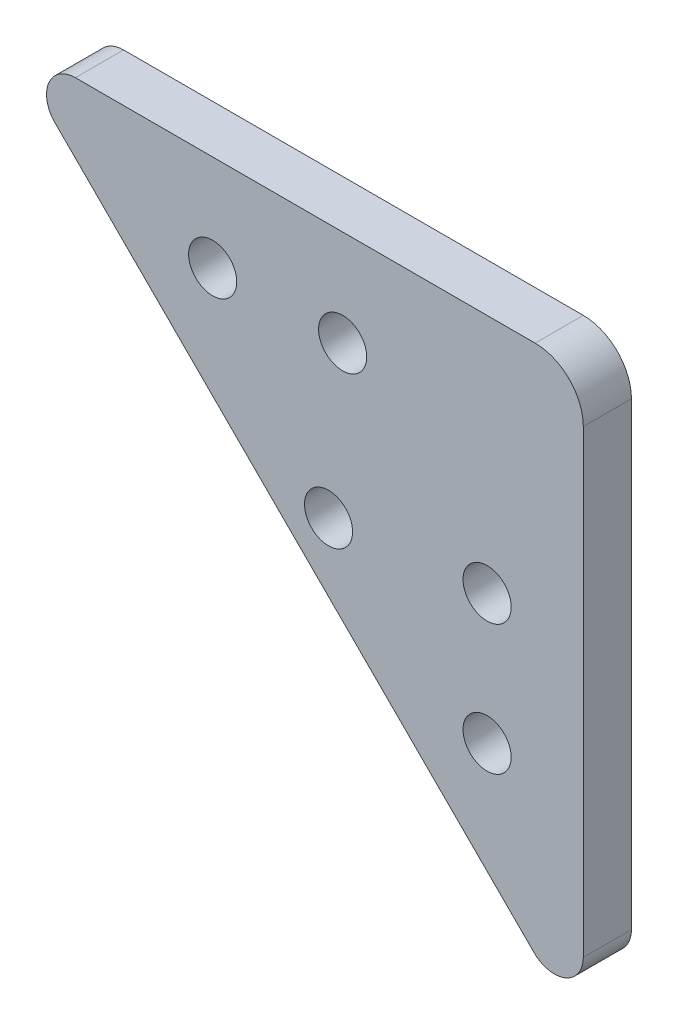
ISO-10303-21;
HEADER;
FILE_DESCRIPTION(('STEP AP214'),'2;1');
FILE_NAME('part.step','',(''),(''),'','','');
FILE_SCHEMA(('AUTOMOTIVE_DESIGN { 1 0 10303 214 1 1 1 1 }'));
ENDSEC;
DATA;
#1=APPLICATION_CONTEXT('core data for automotive mechanical design processes');
#2=APPLICATION_PROTOCOL_DEFINITION('international standard','automotive_design',2000,#1);
#3=PRODUCT_CONTEXT('',#1,'mechanical');
#4=PRODUCT('Part','Part','',(#3));
#5=PRODUCT_RELATED_PRODUCT_CATEGORY('part','',(#4));
#6=PRODUCT_DEFINITION_FORMATION('','',#4);
#7=PRODUCT_DEFINITION_CONTEXT('part definition',#1,'design');
#8=PRODUCT_DEFINITION('design','',#6,#7);
#9=PRODUCT_DEFINITION_SHAPE('','',#8);
#10=(LENGTH_UNIT() NAMED_UNIT(*) SI_UNIT(.MILLI.,.METRE.));
#11=(NAMED_UNIT(*) PLANE_ANGLE_UNIT() SI_UNIT($,.RADIAN.));
#12=(NAMED_UNIT(*) SI_UNIT($,.STERADIAN.) SOLID_ANGLE_UNIT());
#13=UNCERTAINTY_MEASURE_WITH_UNIT(LENGTH_MEASURE(1.E-05),#10,'distance_accuracy_value','');
#14=(GEOMETRIC_REPRESENTATION_CONTEXT(3) GLOBAL_UNCERTAINTY_ASSIGNED_CONTEXT((#13)) GLOBAL_UNIT_ASSIGNED_CONTEXT((#10,
#11,#12)) REPRESENTATION_CONTEXT('',''));
#15=CARTESIAN_POINT('',(0.,0.,0.));
#16=DIRECTION('',(0.,0.,1.));
#17=DIRECTION('',(1.,0.,0.));
#18=AXIS2_PLACEMENT_3D('',#15,#16,#17);
#19=CARTESIAN_POINT('',(25.,25.,5.));
#20=DIRECTION('',(0.,0.,-1.));
#21=DIRECTION('',(-1.,0.,0.));
#22=AXIS2_PLACEMENT_3D('',#19,#20,#21);
#23=PLANE('',#22);
#24=CARTESIAN_POINT('',(25.,25.,5.));
#25=DIRECTION('',(0.,0.,1.));
#26=DIRECTION('',(-1.,0.,0.));
#27=AXIS2_PLACEMENT_3D('',#24,#25,#26);
#28=CIRCLE('',#27,5.);
#29=CARTESIAN_POINT('',(30.,25.,5.));
#30=VERTEX_POINT('',#29);
#31=CARTESIAN_POINT('',(25.,30.,5.));
#32=VERTEX_POINT('',#31);
#33=EDGE_CURVE('E131',#30,#32,#28,.T.);
#34=ORIENTED_EDGE('',*,*,#33,.T.);
#35=DIRECTION('',(-1.,0.,0.));
#36=VECTOR('',#35,1.);
#37=CARTESIAN_POINT('',(-22.7573593128808,30.,5.));
#38=LINE('',#37,#36);
#39=CARTESIAN_POINT('',(-22.7573593128808,30.,5.));
#40=VERTEX_POINT('',#39);
#41=EDGE_CURVE('E89',#32,#40,#38,.T.);
#42=ORIENTED_EDGE('',*,*,#41,.T.);
#43=CARTESIAN_POINT('',(-22.7573593128808,27.,5.));
#44=DIRECTION('',(0.,0.,1.));
#45=DIRECTION('',(1.,0.,0.));
#46=AXIS2_PLACEMENT_3D('',#43,#44,#45);
#47=CIRCLE('',#46,3.00000000000001);
#48=CARTESIAN_POINT('',(-24.8786796564405,24.8786796564404,5.));
#49=VERTEX_POINT('',#48);
#50=EDGE_CURVE('E102',#40,#49,#47,.T.);
#51=ORIENTED_EDGE('',*,*,#50,.T.);
#52=DIRECTION('',(0.707106781186542,-0.707106781186553,0.));
#53=VECTOR('',#52,1.);
#54=CARTESIAN_POINT('',(24.8786796564403,-24.8786796564412,5.));
#55=LINE('',#54,#53);
#56=CARTESIAN_POINT('',(24.8786796564403,-24.8786796564412,5.));
#57=VERTEX_POINT('',#56);
#58=EDGE_CURVE('E96',#49,#57,#55,.T.);
#59=ORIENTED_EDGE('',*,*,#58,.T.);
#60=CARTESIAN_POINT('',(27.,-22.7573593128816,5.));
#61=DIRECTION('',(0.,0.,1.));
#62=DIRECTION('',(-1.,0.,0.));
#63=AXIS2_PLACEMENT_3D('',#60,#61,#62);
#64=CIRCLE('',#63,3.);
#65=CARTESIAN_POINT('',(30.,-22.7573593128816,5.));
#66=VERTEX_POINT('',#65);
#67=EDGE_CURVE('E100',#57,#66,#64,.T.);
#68=ORIENTED_EDGE('',*,*,#67,.T.);
#69=DIRECTION('',(0.,1.,0.));
#70=VECTOR('',#69,1.);
#71=CARTESIAN_POINT('',(30.,25.,5.));
#72=LINE('',#71,#70);
#73=EDGE_CURVE('E52',#66,#30,#72,.T.);
#74=ORIENTED_EDGE('',*,*,#73,.T.);
#75=EDGE_LOOP('',(#34,#42,#51,#59,#68,#74));
#76=FACE_BOUND('',#75,.T.);
#77=CARTESIAN_POINT('',(4.99999999999998,20.0064423388467,5.));
#78=DIRECTION('',(0.,0.,1.));
#79=DIRECTION('',(1.,0.,0.));
#80=AXIS2_PLACEMENT_3D('',#77,#78,#79);
#81=CIRCLE('',#80,2.5);
#82=CARTESIAN_POINT('',(7.49999999999998,20.0064423388467,5.));
#83=VERTEX_POINT('',#82);
#84=EDGE_CURVE('E124',#83,#83,#81,.T.);
#85=ORIENTED_EDGE('',*,*,#84,.F.);
#86=EDGE_LOOP('',(#85));
#87=FACE_BOUND('',#86,.T.);
#88=CARTESIAN_POINT('',(-8.50000000000002,20.0064423388467,5.));
#89=DIRECTION('',(0.,0.,1.));
#90=DIRECTION('',(1.,0.,0.));
#91=AXIS2_PLACEMENT_3D('',#88,#89,#90);
#92=CIRCLE('',#91,2.5);
#93=CARTESIAN_POINT('',(-6.00000000000002,20.0064423388467,5.));
#94=VERTEX_POINT('',#93);
#95=EDGE_CURVE('E205',#94,#94,#92,.T.);
#96=ORIENTED_EDGE('',*,*,#95,.F.);
#97=EDGE_LOOP('',(#96));
#98=FACE_BOUND('',#97,.T.);
#99=CARTESIAN_POINT('',(20.0064423388467,4.99999999999999,5.));
#100=DIRECTION('',(0.,0.,1.));
#101=DIRECTION('',(-1.,0.,0.));
#102=AXIS2_PLACEMENT_3D('',#99,#100,#101);
#103=CIRCLE('',#102,2.5);
#104=CARTESIAN_POINT('',(17.5064423388467,4.99999999999999,5.));
#105=VERTEX_POINT('',#104);
#106=EDGE_CURVE('E199',#105,#105,#103,.T.);
#107=ORIENTED_EDGE('',*,*,#106,.F.);
#108=EDGE_LOOP('',(#107));
#109=FACE_BOUND('',#108,.T.);
#110=CARTESIAN_POINT('',(20.0064423388467,-8.50000000000001,5.));
#111=DIRECTION('',(0.,0.,1.));
#112=DIRECTION('',(-1.,0.,0.));
#113=AXIS2_PLACEMENT_3D('',#110,#111,#112);
#114=CIRCLE('',#113,2.5);
#115=CARTESIAN_POINT('',(17.5064423388467,-8.50000000000001,5.));
#116=VERTEX_POINT('',#115);
#117=EDGE_CURVE('E193',#116,#116,#114,.T.);
#118=ORIENTED_EDGE('',*,*,#117,.F.);
#119=EDGE_LOOP('',(#118));
#120=FACE_BOUND('',#119,.T.);
#121=CARTESIAN_POINT('',(3.53553390593274,3.53553390593274,5.));
#122=DIRECTION('',(0.,0.,1.));
#123=DIRECTION('',(1.,0.,0.));
#124=AXIS2_PLACEMENT_3D('',#121,#122,#123);
#125=CIRCLE('',#124,2.5);
#126=CARTESIAN_POINT('',(6.03553390593274,3.53553390593274,5.));
#127=VERTEX_POINT('',#126);
#128=EDGE_CURVE('E184',#127,#127,#125,.T.);
#129=ORIENTED_EDGE('',*,*,#128,.F.);
#130=EDGE_LOOP('',(#129));
#131=FACE_BOUND('',#130,.T.);
#132=ADVANCED_FACE('F35',(#76,#87,#98,#109,#120,#131),#23,.F.);
#133=CARTESIAN_POINT('',(25.,25.,0.));
#134=DIRECTION('',(0.,0.,-1.));
#135=DIRECTION('',(-1.,0.,0.));
#136=AXIS2_PLACEMENT_3D('',#133,#134,#135);
#137=PLANE('',#136);
#138=CARTESIAN_POINT('',(20.0064423388467,-8.50000000000001,0.));
#139=DIRECTION('',(0.,0.,1.));
#140=DIRECTION('',(-1.,0.,0.));
#141=AXIS2_PLACEMENT_3D('',#138,#139,#140);
#142=CIRCLE('',#141,2.5);
#143=CARTESIAN_POINT('',(17.5064423388467,-8.50000000000001,0.));
#144=VERTEX_POINT('',#143);
#145=EDGE_CURVE('E190',#144,#144,#142,.T.);
#146=ORIENTED_EDGE('',*,*,#145,.T.);
#147=EDGE_LOOP('',(#146));
#148=FACE_BOUND('',#147,.T.);
#149=CARTESIAN_POINT('',(-8.50000000000002,20.0064423388467,0.));
#150=DIRECTION('',(0.,0.,1.));
#151=DIRECTION('',(1.,0.,0.));
#152=AXIS2_PLACEMENT_3D('',#149,#150,#151);
#153=CIRCLE('',#152,2.5);
#154=CARTESIAN_POINT('',(-6.00000000000002,20.0064423388467,0.));
#155=VERTEX_POINT('',#154);
#156=EDGE_CURVE('E202',#155,#155,#153,.T.);
#157=ORIENTED_EDGE('',*,*,#156,.T.);
#158=EDGE_LOOP('',(#157));
#159=FACE_BOUND('',#158,.T.);
#160=CARTESIAN_POINT('',(25.,25.,0.));
#161=DIRECTION('',(0.,0.,1.));
#162=DIRECTION('',(-1.,0.,0.));
#163=AXIS2_PLACEMENT_3D('',#160,#161,#162);
#164=CIRCLE('',#163,5.);
#165=CARTESIAN_POINT('',(30.,25.,0.));
#166=VERTEX_POINT('',#165);
#167=CARTESIAN_POINT('',(25.,30.,0.));
#168=VERTEX_POINT('',#167);
#169=EDGE_CURVE('E120',#166,#168,#164,.T.);
#170=ORIENTED_EDGE('',*,*,#169,.F.);
#171=DIRECTION('',(0.,1.,0.));
#172=VECTOR('',#171,1.);
#173=CARTESIAN_POINT('',(30.,25.,0.));
#174=LINE('',#173,#172);
#175=CARTESIAN_POINT('',(30.,-22.7573593128816,0.));
#176=VERTEX_POINT('',#175);
#177=EDGE_CURVE('E81',#176,#166,#174,.T.);
#178=ORIENTED_EDGE('',*,*,#177,.F.);
#179=CARTESIAN_POINT('',(27.,-22.7573593128816,0.));
#180=DIRECTION('',(0.,0.,1.));
#181=DIRECTION('',(-1.,0.,0.));
#182=AXIS2_PLACEMENT_3D('',#179,#180,#181);
#183=CIRCLE('',#182,3.);
#184=CARTESIAN_POINT('',(24.8786796564403,-24.8786796564412,0.));
#185=VERTEX_POINT('',#184);
#186=EDGE_CURVE('E75',#185,#176,#183,.T.);
#187=ORIENTED_EDGE('',*,*,#186,.F.);
#188=DIRECTION('',(0.707106781186542,-0.707106781186553,0.));
#189=VECTOR('',#188,1.);
#190=CARTESIAN_POINT('',(24.8786796564403,-24.8786796564412,0.));
#191=LINE('',#190,#189);
#192=CARTESIAN_POINT('',(-24.8786796564405,24.8786796564404,0.));
#193=VERTEX_POINT('',#192);
#194=EDGE_CURVE('E110',#193,#185,#191,.T.);
#195=ORIENTED_EDGE('',*,*,#194,.F.);
#196=CARTESIAN_POINT('',(-22.7573593128808,27.,0.));
#197=DIRECTION('',(0.,0.,1.));
#198=DIRECTION('',(1.,0.,0.));
#199=AXIS2_PLACEMENT_3D('',#196,#197,#198);
#200=CIRCLE('',#199,3.00000000000001);
#201=CARTESIAN_POINT('',(-22.7573593128808,30.,0.));
#202=VERTEX_POINT('',#201);
#203=EDGE_CURVE('E126',#202,#193,#200,.T.);
#204=ORIENTED_EDGE('',*,*,#203,.F.);
#205=DIRECTION('',(-1.,0.,0.));
#206=VECTOR('',#205,1.);
#207=CARTESIAN_POINT('',(-22.7573593128808,30.,0.));
#208=LINE('',#207,#206);
#209=EDGE_CURVE('E123',#168,#202,#208,.T.);
#210=ORIENTED_EDGE('',*,*,#209,.F.);
#211=EDGE_LOOP('',(#170,#178,#187,#195,#204,#210));
#212=FACE_BOUND('',#211,.T.);
#213=CARTESIAN_POINT('',(4.99999999999998,20.0064423388467,0.));
#214=DIRECTION('',(0.,0.,1.));
#215=DIRECTION('',(1.,0.,0.));
#216=AXIS2_PLACEMENT_3D('',#213,#214,#215);
#217=CIRCLE('',#216,2.5);
#218=CARTESIAN_POINT('',(7.49999999999998,20.0064423388467,0.));
#219=VERTEX_POINT('',#218);
#220=EDGE_CURVE('E208',#219,#219,#217,.T.);
#221=ORIENTED_EDGE('',*,*,#220,.T.);
#222=EDGE_LOOP('',(#221));
#223=FACE_BOUND('',#222,.T.);
#224=CARTESIAN_POINT('',(20.0064423388467,4.99999999999999,0.));
#225=DIRECTION('',(0.,0.,1.));
#226=DIRECTION('',(-1.,0.,0.));
#227=AXIS2_PLACEMENT_3D('',#224,#225,#226);
#228=CIRCLE('',#227,2.5);
#229=CARTESIAN_POINT('',(17.5064423388467,4.99999999999999,0.));
#230=VERTEX_POINT('',#229);
#231=EDGE_CURVE('E196',#230,#230,#228,.T.);
#232=ORIENTED_EDGE('',*,*,#231,.T.);
#233=EDGE_LOOP('',(#232));
#234=FACE_BOUND('',#233,.T.);
#235=CARTESIAN_POINT('',(3.53553390593274,3.53553390593274,0.));
#236=DIRECTION('',(0.,0.,1.));
#237=DIRECTION('',(1.,0.,0.));
#238=AXIS2_PLACEMENT_3D('',#235,#236,#237);
#239=CIRCLE('',#238,2.5);
#240=CARTESIAN_POINT('',(6.03553390593274,3.53553390593274,0.));
#241=VERTEX_POINT('',#240);
#242=EDGE_CURVE('E187',#241,#241,#239,.T.);
#243=ORIENTED_EDGE('',*,*,#242,.T.);
#244=EDGE_LOOP('',(#243));
#245=FACE_BOUND('',#244,.T.);
#246=ADVANCED_FACE('F140',(#148,#159,#212,#223,#234,#245),#137,.T.);
#247=CARTESIAN_POINT('',(25.,25.,5.));
#248=DIRECTION('',(0.,0.,-1.));
#249=DIRECTION('',(-1.,0.,0.));
#250=AXIS2_PLACEMENT_3D('',#247,#248,#249);
#251=CYLINDRICAL_SURFACE('',#250,5.);
#252=ORIENTED_EDGE('',*,*,#169,.T.);
#253=DIRECTION('',(0.,0.,-1.));
#254=VECTOR('',#253,1.);
#255=CARTESIAN_POINT('',(25.,30.,5.));
#256=LINE('',#255,#254);
#257=EDGE_CURVE('E11',#32,#168,#256,.T.);
#258=ORIENTED_EDGE('',*,*,#257,.F.);
#259=ORIENTED_EDGE('',*,*,#33,.F.);
#260=DIRECTION('',(0.,0.,-1.));
#261=VECTOR('',#260,1.);
#262=CARTESIAN_POINT('',(30.,25.,5.));
#263=LINE('',#262,#261);
#264=EDGE_CURVE('E116',#30,#166,#263,.T.);
#265=ORIENTED_EDGE('',*,*,#264,.T.);
#266=EDGE_LOOP('',(#252,#258,#259,#265));
#267=FACE_BOUND('',#266,.T.);
#268=ADVANCED_FACE('F37',(#267),#251,.T.);
#269=CARTESIAN_POINT('',(-22.7573593128808,30.,5.));
#270=DIRECTION('',(0.,-1.,0.));
#271=DIRECTION('',(1.,0.,0.));
#272=AXIS2_PLACEMENT_3D('',#269,#270,#271);
#273=PLANE('',#272);
#274=ORIENTED_EDGE('',*,*,#209,.T.);
#275=DIRECTION('',(0.,0.,-1.));
#276=VECTOR('',#275,1.);
#277=CARTESIAN_POINT('',(-22.7573593128808,30.,5.));
#278=LINE('',#277,#276);
#279=EDGE_CURVE('E44',#40,#202,#278,.T.);
#280=ORIENTED_EDGE('',*,*,#279,.F.);
#281=ORIENTED_EDGE('',*,*,#41,.F.);
#282=ORIENTED_EDGE('',*,*,#257,.T.);
#283=EDGE_LOOP('',(#274,#280,#281,#282));
#284=FACE_BOUND('',#283,.T.);
#285=ADVANCED_FACE('F277',(#284),#273,.F.);
#286=CARTESIAN_POINT('',(-22.7573593128808,27.,5.));
#287=DIRECTION('',(0.,0.,-1.));
#288=DIRECTION('',(-1.,0.,0.));
#289=AXIS2_PLACEMENT_3D('',#286,#287,#288);
#290=CYLINDRICAL_SURFACE('',#289,3.00000000000001);
#291=ORIENTED_EDGE('',*,*,#203,.T.);
#292=DIRECTION('',(0.,0.,-1.));
#293=VECTOR('',#292,1.);
#294=CARTESIAN_POINT('',(-24.8786796564405,24.8786796564404,5.));
#295=LINE('',#294,#293);
#296=EDGE_CURVE('E111',#49,#193,#295,.T.);
#297=ORIENTED_EDGE('',*,*,#296,.F.);
#298=ORIENTED_EDGE('',*,*,#50,.F.);
#299=ORIENTED_EDGE('',*,*,#279,.T.);
#300=EDGE_LOOP('',(#291,#297,#298,#299));
#301=FACE_BOUND('',#300,.T.);
#302=ADVANCED_FACE('F137',(#301),#290,.T.);
#303=CARTESIAN_POINT('',(24.8786796564403,-24.8786796564412,5.));
#304=DIRECTION('',(0.707106781186553,0.707106781186542,0.));
#305=DIRECTION('',(-0.707106781186542,0.707106781186553,0.));
#306=AXIS2_PLACEMENT_3D('',#303,#304,#305);
#307=PLANE('',#306);
#308=ORIENTED_EDGE('',*,*,#194,.T.);
#309=DIRECTION('',(0.,0.,-1.));
#310=VECTOR('',#309,1.);
#311=CARTESIAN_POINT('',(24.8786796564403,-24.8786796564412,5.));
#312=LINE('',#311,#310);
#313=EDGE_CURVE('E107',#57,#185,#312,.T.);
#314=ORIENTED_EDGE('',*,*,#313,.F.);
#315=ORIENTED_EDGE('',*,*,#58,.F.);
#316=ORIENTED_EDGE('',*,*,#296,.T.);
#317=EDGE_LOOP('',(#308,#314,#315,#316));
#318=FACE_BOUND('',#317,.T.);
#319=ADVANCED_FACE('F108',(#318),#307,.F.);
#320=CARTESIAN_POINT('',(27.,-22.7573593128816,5.));
#321=DIRECTION('',(0.,0.,-1.));
#322=DIRECTION('',(-1.,0.,0.));
#323=AXIS2_PLACEMENT_3D('',#320,#321,#322);
#324=CYLINDRICAL_SURFACE('',#323,3.);
#325=ORIENTED_EDGE('',*,*,#186,.T.);
#326=DIRECTION('',(0.,0.,-1.));
#327=VECTOR('',#326,1.);
#328=CARTESIAN_POINT('',(30.,-22.7573593128816,5.));
#329=LINE('',#328,#327);
#330=EDGE_CURVE('E112',#66,#176,#329,.T.);
#331=ORIENTED_EDGE('',*,*,#330,.F.);
#332=ORIENTED_EDGE('',*,*,#67,.F.);
#333=ORIENTED_EDGE('',*,*,#313,.T.);
#334=EDGE_LOOP('',(#325,#331,#332,#333));
#335=FACE_BOUND('',#334,.T.);
#336=ADVANCED_FACE('F114',(#335),#324,.T.);
#337=CARTESIAN_POINT('',(30.,25.,5.));
#338=DIRECTION('',(-1.,0.,0.));
#339=DIRECTION('',(0.,0.,1.));
#340=AXIS2_PLACEMENT_3D('',#337,#338,#339);
#341=PLANE('',#340);
#342=ORIENTED_EDGE('',*,*,#177,.T.);
#343=ORIENTED_EDGE('',*,*,#264,.F.);
#344=ORIENTED_EDGE('',*,*,#73,.F.);
#345=ORIENTED_EDGE('',*,*,#330,.T.);
#346=EDGE_LOOP('',(#342,#343,#344,#345));
#347=FACE_BOUND('',#346,.T.);
#348=ADVANCED_FACE('F145',(#347),#341,.F.);
#349=CARTESIAN_POINT('',(4.99999999999998,20.0064423388467,5.));
#350=DIRECTION('',(0.,0.,-1.));
#351=DIRECTION('',(-1.,0.,0.));
#352=AXIS2_PLACEMENT_3D('',#349,#350,#351);
#353=CYLINDRICAL_SURFACE('',#352,2.5);
#354=ORIENTED_EDGE('',*,*,#84,.T.);
#355=EDGE_LOOP('',(#354));
#356=FACE_BOUND('',#355,.T.);
#357=ORIENTED_EDGE('',*,*,#220,.F.);
#358=EDGE_LOOP('',(#357));
#359=FACE_BOUND('',#358,.T.);
#360=ADVANCED_FACE('F147',(#356,#359),#353,.F.);
#361=CARTESIAN_POINT('',(-8.50000000000002,20.0064423388467,5.));
#362=DIRECTION('',(0.,0.,-1.));
#363=DIRECTION('',(-1.,0.,0.));
#364=AXIS2_PLACEMENT_3D('',#361,#362,#363);
#365=CYLINDRICAL_SURFACE('',#364,2.5);
#366=ORIENTED_EDGE('',*,*,#95,.T.);
#367=EDGE_LOOP('',(#366));
#368=FACE_BOUND('',#367,.T.);
#369=ORIENTED_EDGE('',*,*,#156,.F.);
#370=EDGE_LOOP('',(#369));
#371=FACE_BOUND('',#370,.T.);
#372=ADVANCED_FACE('F153',(#368,#371),#365,.F.);
#373=CARTESIAN_POINT('',(20.0064423388467,4.99999999999999,5.));
#374=DIRECTION('',(0.,0.,-1.));
#375=DIRECTION('',(-1.,0.,0.));
#376=AXIS2_PLACEMENT_3D('',#373,#374,#375);
#377=CYLINDRICAL_SURFACE('',#376,2.5);
#378=ORIENTED_EDGE('',*,*,#106,.T.);
#379=EDGE_LOOP('',(#378));
#380=FACE_BOUND('',#379,.T.);
#381=ORIENTED_EDGE('',*,*,#231,.F.);
#382=EDGE_LOOP('',(#381));
#383=FACE_BOUND('',#382,.T.);
#384=ADVANCED_FACE('F167',(#380,#383),#377,.F.);
#385=CARTESIAN_POINT('',(20.0064423388467,-8.50000000000001,5.));
#386=DIRECTION('',(0.,0.,-1.));
#387=DIRECTION('',(-1.,0.,0.));
#388=AXIS2_PLACEMENT_3D('',#385,#386,#387);
#389=CYLINDRICAL_SURFACE('',#388,2.5);
#390=ORIENTED_EDGE('',*,*,#117,.T.);
#391=EDGE_LOOP('',(#390));
#392=FACE_BOUND('',#391,.T.);
#393=ORIENTED_EDGE('',*,*,#145,.F.);
#394=EDGE_LOOP('',(#393));
#395=FACE_BOUND('',#394,.T.);
#396=ADVANCED_FACE('F171',(#392,#395),#389,.F.);
#397=CARTESIAN_POINT('',(3.53553390593274,3.53553390593274,5.));
#398=DIRECTION('',(0.,0.,-1.));
#399=DIRECTION('',(-1.,0.,0.));
#400=AXIS2_PLACEMENT_3D('',#397,#398,#399);
#401=CYLINDRICAL_SURFACE('',#400,2.5);
#402=ORIENTED_EDGE('',*,*,#128,.T.);
#403=EDGE_LOOP('',(#402));
#404=FACE_BOUND('',#403,.T.);
#405=ORIENTED_EDGE('',*,*,#242,.F.);
#406=EDGE_LOOP('',(#405));
#407=FACE_BOUND('',#406,.T.);
#408=ADVANCED_FACE('F175',(#404,#407),#401,.F.);
#409=CLOSED_SHELL('',(#132,#246,#268,#285,#302,#319,#336,#348,#360,#372,#384,#396,#408));
#410=MANIFOLD_SOLID_BREP('B2',#409);
#411=ADVANCED_BREP_SHAPE_REPRESENTATION('',(#18,#410),#14);
#412=SHAPE_DEFINITION_REPRESENTATION(#9,#411);
ENDSEC;
END-ISO-10303-21;
